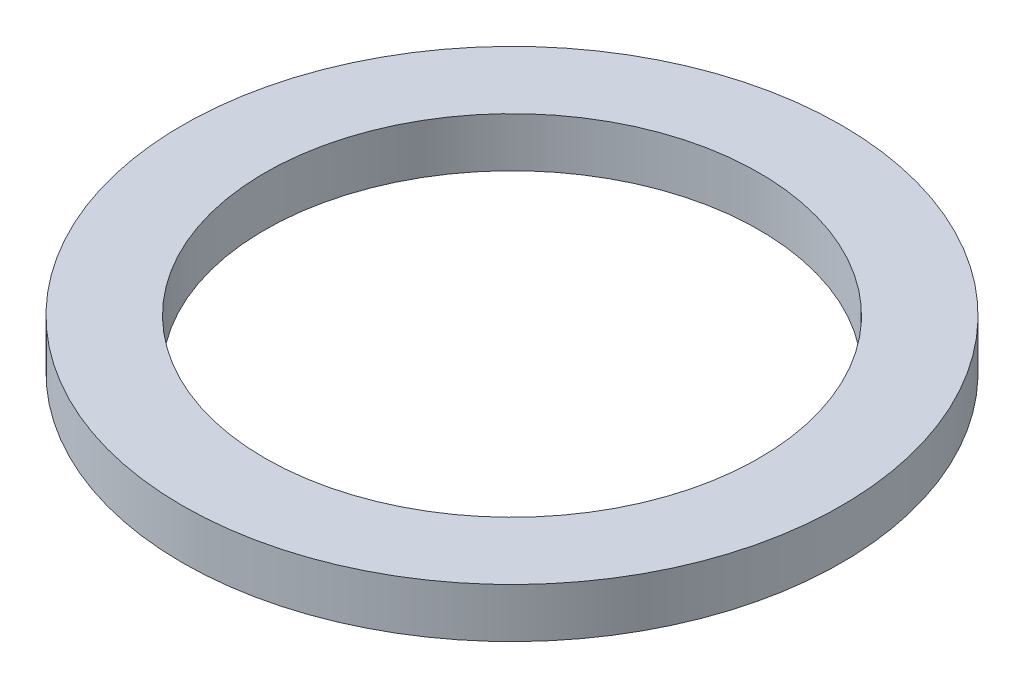
ISO-10303-21;
HEADER;
FILE_DESCRIPTION(('STEP AP214'),'2;1');
FILE_NAME('part.step','',(''),(''),'','','');
FILE_SCHEMA(('AUTOMOTIVE_DESIGN { 1 0 10303 214 1 1 1 1 }'));
ENDSEC;
DATA;
#1=APPLICATION_CONTEXT('core data for automotive mechanical design processes');
#2=APPLICATION_PROTOCOL_DEFINITION('international standard','automotive_design',2000,#1);
#3=PRODUCT_CONTEXT('',#1,'mechanical');
#4=PRODUCT('Part','Part','',(#3));
#5=PRODUCT_RELATED_PRODUCT_CATEGORY('part','',(#4));
#6=PRODUCT_DEFINITION_FORMATION('','',#4);
#7=PRODUCT_DEFINITION_CONTEXT('part definition',#1,'design');
#8=PRODUCT_DEFINITION('design','',#6,#7);
#9=PRODUCT_DEFINITION_SHAPE('','',#8);
#10=(LENGTH_UNIT() NAMED_UNIT(*) SI_UNIT(.MILLI.,.METRE.));
#11=(NAMED_UNIT(*) PLANE_ANGLE_UNIT() SI_UNIT($,.RADIAN.));
#12=(NAMED_UNIT(*) SI_UNIT($,.STERADIAN.) SOLID_ANGLE_UNIT());
#13=UNCERTAINTY_MEASURE_WITH_UNIT(LENGTH_MEASURE(1.E-05),#10,'distance_accuracy_value','');
#14=(GEOMETRIC_REPRESENTATION_CONTEXT(3) GLOBAL_UNCERTAINTY_ASSIGNED_CONTEXT((#13)) GLOBAL_UNIT_ASSIGNED_CONTEXT((#10,
#11,#12)) REPRESENTATION_CONTEXT('',''));
#15=CARTESIAN_POINT('',(0.,0.,0.));
#16=DIRECTION('',(0.,0.,1.));
#17=DIRECTION('',(1.,0.,0.));
#18=AXIS2_PLACEMENT_3D('',#15,#16,#17);
#19=CARTESIAN_POINT('',(0.,9.,0.));
#20=DIRECTION('',(0.,-1.,0.));
#21=DIRECTION('',(0.,0.,-1.));
#22=AXIS2_PLACEMENT_3D('',#19,#20,#21);
#23=CYLINDRICAL_SURFACE('',#22,60.);
#24=CARTESIAN_POINT('',(0.,9.,0.));
#25=DIRECTION('',(0.,1.,0.));
#26=DIRECTION('',(0.,0.,1.));
#27=AXIS2_PLACEMENT_3D('',#24,#25,#26);
#28=CIRCLE('',#27,60.);
#29=CARTESIAN_POINT('',(0.,9.,60.));
#30=VERTEX_POINT('',#29);
#31=EDGE_CURVE('E10',#30,#30,#28,.T.);
#32=ORIENTED_EDGE('',*,*,#31,.F.);
#33=EDGE_LOOP('',(#32));
#34=FACE_BOUND('',#33,.T.);
#35=CARTESIAN_POINT('',(0.,0.,0.));
#36=DIRECTION('',(0.,1.,0.));
#37=DIRECTION('',(0.,0.,1.));
#38=AXIS2_PLACEMENT_3D('',#35,#36,#37);
#39=CIRCLE('',#38,60.);
#40=CARTESIAN_POINT('',(0.,0.,60.));
#41=VERTEX_POINT('',#40);
#42=EDGE_CURVE('E37',#41,#41,#39,.T.);
#43=ORIENTED_EDGE('',*,*,#42,.T.);
#44=EDGE_LOOP('',(#43));
#45=FACE_BOUND('',#44,.T.);
#46=ADVANCED_FACE('F40',(#34,#45),#23,.T.);
#47=CARTESIAN_POINT('',(0.,9.,0.));
#48=DIRECTION('',(0.,1.,0.));
#49=DIRECTION('',(0.,0.,1.));
#50=AXIS2_PLACEMENT_3D('',#47,#48,#49);
#51=PLANE('',#50);
#52=CARTESIAN_POINT('',(0.,9.,0.));
#53=DIRECTION('',(0.,1.,0.));
#54=DIRECTION('',(0.,0.,1.));
#55=AXIS2_PLACEMENT_3D('',#52,#53,#54);
#56=CIRCLE('',#55,45.);
#57=CARTESIAN_POINT('',(0.,9.,45.));
#58=VERTEX_POINT('',#57);
#59=EDGE_CURVE('E50',#58,#58,#56,.T.);
#60=ORIENTED_EDGE('',*,*,#59,.F.);
#61=EDGE_LOOP('',(#60));
#62=FACE_BOUND('',#61,.T.);
#63=ORIENTED_EDGE('',*,*,#31,.T.);
#64=EDGE_LOOP('',(#63));
#65=FACE_BOUND('',#64,.T.);
#66=ADVANCED_FACE('F59',(#62,#65),#51,.T.);
#67=CARTESIAN_POINT('',(0.,0.,0.));
#68=DIRECTION('',(0.,1.,0.));
#69=DIRECTION('',(0.,0.,1.));
#70=AXIS2_PLACEMENT_3D('',#67,#68,#69);
#71=PLANE('',#70);
#72=CARTESIAN_POINT('',(0.,0.,0.));
#73=DIRECTION('',(0.,1.,0.));
#74=DIRECTION('',(0.,0.,1.));
#75=AXIS2_PLACEMENT_3D('',#72,#73,#74);
#76=CIRCLE('',#75,45.);
#77=CARTESIAN_POINT('',(0.,0.,45.));
#78=VERTEX_POINT('',#77);
#79=EDGE_CURVE('E47',#78,#78,#76,.T.);
#80=ORIENTED_EDGE('',*,*,#79,.T.);
#81=EDGE_LOOP('',(#80));
#82=FACE_BOUND('',#81,.T.);
#83=ORIENTED_EDGE('',*,*,#42,.F.);
#84=EDGE_LOOP('',(#83));
#85=FACE_BOUND('',#84,.T.);
#86=ADVANCED_FACE('F58',(#82,#85),#71,.F.);
#87=CARTESIAN_POINT('',(0.,9.,0.));
#88=DIRECTION('',(0.,-1.,0.));
#89=DIRECTION('',(0.,0.,-1.));
#90=AXIS2_PLACEMENT_3D('',#87,#88,#89);
#91=CYLINDRICAL_SURFACE('',#90,45.);
#92=ORIENTED_EDGE('',*,*,#59,.T.);
#93=EDGE_LOOP('',(#92));
#94=FACE_BOUND('',#93,.T.);
#95=ORIENTED_EDGE('',*,*,#79,.F.);
#96=EDGE_LOOP('',(#95));
#97=FACE_BOUND('',#96,.T.);
#98=ADVANCED_FACE('F54',(#94,#97),#91,.F.);
#99=CLOSED_SHELL('',(#46,#66,#86,#98));
#100=MANIFOLD_SOLID_BREP('B2',#99);
#101=ADVANCED_BREP_SHAPE_REPRESENTATION('',(#18,#100),#14);
#102=SHAPE_DEFINITION_REPRESENTATION(#9,#101);
ENDSEC;
END-ISO-10303-21;
